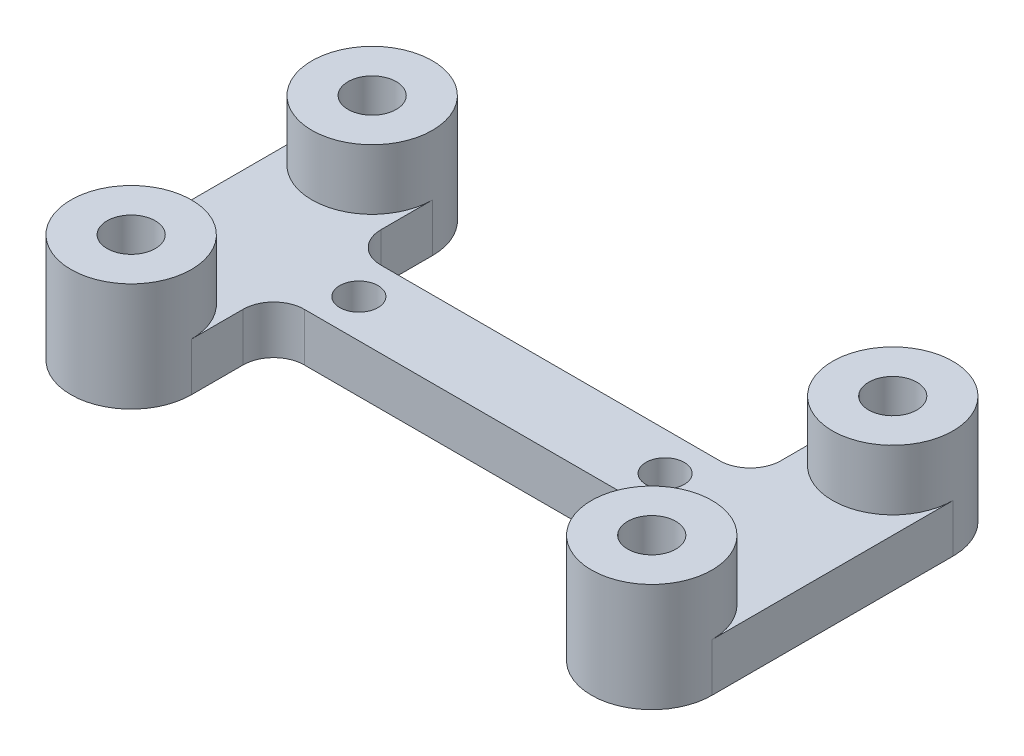
ISO-10303-21;
HEADER;
FILE_DESCRIPTION(('STEP AP214'),'2;1');
FILE_NAME('part.step','',(''),(''),'','','');
FILE_SCHEMA(('AUTOMOTIVE_DESIGN { 1 0 10303 214 1 1 1 1 }'));
ENDSEC;
DATA;
#1=APPLICATION_CONTEXT('core data for automotive mechanical design processes');
#2=APPLICATION_PROTOCOL_DEFINITION('international standard','automotive_design',2000,#1);
#3=PRODUCT_CONTEXT('',#1,'mechanical');
#4=PRODUCT('Part','Part','',(#3));
#5=PRODUCT_RELATED_PRODUCT_CATEGORY('part','',(#4));
#6=PRODUCT_DEFINITION_FORMATION('','',#4);
#7=PRODUCT_DEFINITION_CONTEXT('part definition',#1,'design');
#8=PRODUCT_DEFINITION('design','',#6,#7);
#9=PRODUCT_DEFINITION_SHAPE('','',#8);
#10=(LENGTH_UNIT() NAMED_UNIT(*) SI_UNIT(.MILLI.,.METRE.));
#11=(NAMED_UNIT(*) PLANE_ANGLE_UNIT() SI_UNIT($,.RADIAN.));
#12=(NAMED_UNIT(*) SI_UNIT($,.STERADIAN.) SOLID_ANGLE_UNIT());
#13=UNCERTAINTY_MEASURE_WITH_UNIT(LENGTH_MEASURE(1.E-05),#10,'distance_accuracy_value','');
#14=(GEOMETRIC_REPRESENTATION_CONTEXT(3) GLOBAL_UNCERTAINTY_ASSIGNED_CONTEXT((#13)) GLOBAL_UNIT_ASSIGNED_CONTEXT((#10,
#11,#12)) REPRESENTATION_CONTEXT('',''));
#15=CARTESIAN_POINT('',(0.,0.,0.));
#16=DIRECTION('',(0.,0.,1.));
#17=DIRECTION('',(1.,0.,0.));
#18=AXIS2_PLACEMENT_3D('',#15,#16,#17);
#19=CARTESIAN_POINT('',(21.59,9.,9.9949));
#20=DIRECTION('',(0.,1.,0.));
#21=DIRECTION('',(0.,0.,1.));
#22=AXIS2_PLACEMENT_3D('',#19,#20,#21);
#23=PLANE('',#22);
#24=CARTESIAN_POINT('',(21.59,9.,9.9949));
#25=DIRECTION('',(0.,1.,0.));
#26=DIRECTION('',(0.,0.,1.));
#27=AXIS2_PLACEMENT_3D('',#24,#25,#26);
#28=CIRCLE('',#27,5.);
#29=CARTESIAN_POINT('',(21.59,9.,14.9949));
#30=VERTEX_POINT('',#29);
#31=EDGE_CURVE('E65',#30,#30,#28,.T.);
#32=ORIENTED_EDGE('',*,*,#31,.T.);
#33=EDGE_LOOP('',(#32));
#34=FACE_BOUND('',#33,.T.);
#35=CARTESIAN_POINT('',(21.59,9.,9.9949));
#36=DIRECTION('',(0.,1.,0.));
#37=DIRECTION('',(0.,0.,1.));
#38=AXIS2_PLACEMENT_3D('',#35,#36,#37);
#39=CIRCLE('',#38,2.);
#40=CARTESIAN_POINT('',(21.59,9.,11.9949));
#41=VERTEX_POINT('',#40);
#42=EDGE_CURVE('E56',#41,#41,#39,.T.);
#43=ORIENTED_EDGE('',*,*,#42,.F.);
#44=EDGE_LOOP('',(#43));
#45=FACE_BOUND('',#44,.T.);
#46=ADVANCED_FACE('F52',(#34,#45),#23,.T.);
#47=CARTESIAN_POINT('',(21.59,0.,9.9949));
#48=DIRECTION('',(0.,1.,0.));
#49=DIRECTION('',(0.,0.,1.));
#50=AXIS2_PLACEMENT_3D('',#47,#48,#49);
#51=PLANE('',#50);
#52=CARTESIAN_POINT('',(21.59,0.,9.9949));
#53=DIRECTION('',(0.,1.,0.));
#54=DIRECTION('',(0.,0.,1.));
#55=AXIS2_PLACEMENT_3D('',#52,#53,#54);
#56=CIRCLE('',#55,5.);
#57=CARTESIAN_POINT('',(21.59,0.,14.9949));
#58=VERTEX_POINT('',#57);
#59=EDGE_CURVE('E63',#58,#58,#56,.T.);
#60=ORIENTED_EDGE('',*,*,#59,.F.);
#61=EDGE_LOOP('',(#60));
#62=FACE_BOUND('',#61,.T.);
#63=CARTESIAN_POINT('',(21.59,0.,9.9949));
#64=DIRECTION('',(0.,1.,0.));
#65=DIRECTION('',(0.,0.,1.));
#66=AXIS2_PLACEMENT_3D('',#63,#64,#65);
#67=CIRCLE('',#66,2.);
#68=CARTESIAN_POINT('',(21.59,0.,11.9949));
#69=VERTEX_POINT('',#68);
#70=EDGE_CURVE('E11',#69,#69,#67,.T.);
#71=ORIENTED_EDGE('',*,*,#70,.T.);
#72=EDGE_LOOP('',(#71));
#73=FACE_BOUND('',#72,.T.);
#74=ADVANCED_FACE('F73',(#62,#73),#51,.F.);
#75=CARTESIAN_POINT('',(21.59,9.,9.9949));
#76=DIRECTION('',(0.,-1.,0.));
#77=DIRECTION('',(0.,0.,-1.));
#78=AXIS2_PLACEMENT_3D('',#75,#76,#77);
#79=CYLINDRICAL_SURFACE('',#78,5.);
#80=ORIENTED_EDGE('',*,*,#31,.F.);
#81=EDGE_LOOP('',(#80));
#82=FACE_BOUND('',#81,.T.);
#83=ORIENTED_EDGE('',*,*,#59,.T.);
#84=EDGE_LOOP('',(#83));
#85=FACE_BOUND('',#84,.T.);
#86=ADVANCED_FACE('F71',(#82,#85),#79,.T.);
#87=CARTESIAN_POINT('',(21.59,9.,9.9949));
#88=DIRECTION('',(0.,-1.,0.));
#89=DIRECTION('',(0.,0.,-1.));
#90=AXIS2_PLACEMENT_3D('',#87,#88,#89);
#91=CYLINDRICAL_SURFACE('',#90,2.);
#92=ORIENTED_EDGE('',*,*,#42,.T.);
#93=EDGE_LOOP('',(#92));
#94=FACE_BOUND('',#93,.T.);
#95=ORIENTED_EDGE('',*,*,#70,.F.);
#96=EDGE_LOOP('',(#95));
#97=FACE_BOUND('',#96,.T.);
#98=ADVANCED_FACE('F54',(#94,#97),#91,.F.);
#99=CLOSED_SHELL('',(#46,#74,#86,#98));
#100=MANIFOLD_SOLID_BREP('B2',#99);
#101=CARTESIAN_POINT('',(21.59,9.,-9.9949));
#102=DIRECTION('',(0.,1.,0.));
#103=DIRECTION('',(0.,0.,1.));
#104=AXIS2_PLACEMENT_3D('',#101,#102,#103);
#105=PLANE('',#104);
#106=CARTESIAN_POINT('',(21.59,9.,-9.9949));
#107=DIRECTION('',(0.,1.,0.));
#108=DIRECTION('',(0.,0.,1.));
#109=AXIS2_PLACEMENT_3D('',#106,#107,#108);
#110=CIRCLE('',#109,5.);
#111=CARTESIAN_POINT('',(21.59,9.,-4.9949));
#112=VERTEX_POINT('',#111);
#113=EDGE_CURVE('E144',#112,#112,#110,.T.);
#114=ORIENTED_EDGE('',*,*,#113,.T.);
#115=EDGE_LOOP('',(#114));
#116=FACE_BOUND('',#115,.T.);
#117=CARTESIAN_POINT('',(21.59,9.,-9.9949));
#118=DIRECTION('',(0.,1.,0.));
#119=DIRECTION('',(0.,0.,1.));
#120=AXIS2_PLACEMENT_3D('',#117,#118,#119);
#121=CIRCLE('',#120,2.);
#122=CARTESIAN_POINT('',(21.59,9.,-7.9949));
#123=VERTEX_POINT('',#122);
#124=EDGE_CURVE('E135',#123,#123,#121,.T.);
#125=ORIENTED_EDGE('',*,*,#124,.F.);
#126=EDGE_LOOP('',(#125));
#127=FACE_BOUND('',#126,.T.);
#128=ADVANCED_FACE('F131',(#116,#127),#105,.T.);
#129=CARTESIAN_POINT('',(21.59,0.,-9.9949));
#130=DIRECTION('',(0.,1.,0.));
#131=DIRECTION('',(0.,0.,1.));
#132=AXIS2_PLACEMENT_3D('',#129,#130,#131);
#133=PLANE('',#132);
#134=CARTESIAN_POINT('',(21.59,0.,-9.9949));
#135=DIRECTION('',(0.,1.,0.));
#136=DIRECTION('',(0.,0.,1.));
#137=AXIS2_PLACEMENT_3D('',#134,#135,#136);
#138=CIRCLE('',#137,5.);
#139=CARTESIAN_POINT('',(21.59,0.,-4.9949));
#140=VERTEX_POINT('',#139);
#141=EDGE_CURVE('E142',#140,#140,#138,.T.);
#142=ORIENTED_EDGE('',*,*,#141,.F.);
#143=EDGE_LOOP('',(#142));
#144=FACE_BOUND('',#143,.T.);
#145=CARTESIAN_POINT('',(21.59,0.,-9.9949));
#146=DIRECTION('',(0.,1.,0.));
#147=DIRECTION('',(0.,0.,1.));
#148=AXIS2_PLACEMENT_3D('',#145,#146,#147);
#149=CIRCLE('',#148,2.);
#150=CARTESIAN_POINT('',(21.59,0.,-7.9949));
#151=VERTEX_POINT('',#150);
#152=EDGE_CURVE('E51',#151,#151,#149,.T.);
#153=ORIENTED_EDGE('',*,*,#152,.T.);
#154=EDGE_LOOP('',(#153));
#155=FACE_BOUND('',#154,.T.);
#156=ADVANCED_FACE('F152',(#144,#155),#133,.F.);
#157=CARTESIAN_POINT('',(21.59,9.,-9.9949));
#158=DIRECTION('',(0.,-1.,0.));
#159=DIRECTION('',(0.,0.,-1.));
#160=AXIS2_PLACEMENT_3D('',#157,#158,#159);
#161=CYLINDRICAL_SURFACE('',#160,5.);
#162=ORIENTED_EDGE('',*,*,#113,.F.);
#163=EDGE_LOOP('',(#162));
#164=FACE_BOUND('',#163,.T.);
#165=ORIENTED_EDGE('',*,*,#141,.T.);
#166=EDGE_LOOP('',(#165));
#167=FACE_BOUND('',#166,.T.);
#168=ADVANCED_FACE('F150',(#164,#167),#161,.T.);
#169=CARTESIAN_POINT('',(21.59,9.,-9.9949));
#170=DIRECTION('',(0.,-1.,0.));
#171=DIRECTION('',(0.,0.,-1.));
#172=AXIS2_PLACEMENT_3D('',#169,#170,#171);
#173=CYLINDRICAL_SURFACE('',#172,2.);
#174=ORIENTED_EDGE('',*,*,#124,.T.);
#175=EDGE_LOOP('',(#174));
#176=FACE_BOUND('',#175,.T.);
#177=ORIENTED_EDGE('',*,*,#152,.F.);
#178=EDGE_LOOP('',(#177));
#179=FACE_BOUND('',#178,.T.);
#180=ADVANCED_FACE('F133',(#176,#179),#173,.F.);
#181=CLOSED_SHELL('',(#128,#156,#168,#180));
#182=MANIFOLD_SOLID_BREP('B6',#181);
#183=CARTESIAN_POINT('',(0.,4.,0.));
#184=DIRECTION('',(0.,1.,0.));
#185=DIRECTION('',(0.,0.,1.));
#186=AXIS2_PLACEMENT_3D('',#183,#184,#185);
#187=PLANE('',#186);
#188=CARTESIAN_POINT('',(-12.7,4.,0.));
#189=DIRECTION('',(0.,1.,0.));
#190=DIRECTION('',(0.,0.,1.));
#191=AXIS2_PLACEMENT_3D('',#188,#189,#190);
#192=CIRCLE('',#191,1.5875);
#193=CARTESIAN_POINT('',(-12.7,4.,1.5875));
#194=VERTEX_POINT('',#193);
#195=EDGE_CURVE('E605',#194,#194,#192,.T.);
#196=ORIENTED_EDGE('',*,*,#195,.F.);
#197=EDGE_LOOP('',(#196));
#198=FACE_BOUND('',#197,.T.);
#199=CARTESIAN_POINT('',(12.7,4.,0.));
#200=DIRECTION('',(0.,1.,0.));
#201=DIRECTION('',(0.,0.,1.));
#202=AXIS2_PLACEMENT_3D('',#199,#200,#201);
#203=CIRCLE('',#202,1.5875);
#204=CARTESIAN_POINT('',(12.7,4.,1.5875));
#205=VERTEX_POINT('',#204);
#206=EDGE_CURVE('E609',#205,#205,#203,.T.);
#207=ORIENTED_EDGE('',*,*,#206,.F.);
#208=EDGE_LOOP('',(#207));
#209=FACE_BOUND('',#208,.T.);
#210=DIRECTION('',(0.,0.,-1.));
#211=VECTOR('',#210,1.);
#212=CARTESIAN_POINT('',(-26.59,4.,0.));
#213=LINE('',#212,#211);
#214=CARTESIAN_POINT('',(-26.59,4.,9.9949));
#215=VERTEX_POINT('',#214);
#216=CARTESIAN_POINT('',(-26.59,4.,-9.9949));
#217=VERTEX_POINT('',#216);
#218=EDGE_CURVE('E460',#215,#217,#213,.T.);
#219=ORIENTED_EDGE('',*,*,#218,.F.);
#220=CARTESIAN_POINT('',(-21.59,4.,9.9949));
#221=DIRECTION('',(0.,1.,0.));
#222=DIRECTION('',(0.,0.,1.));
#223=AXIS2_PLACEMENT_3D('',#220,#221,#222);
#224=CIRCLE('',#223,5.);
#225=CARTESIAN_POINT('',(-16.59,4.,9.9949));
#226=VERTEX_POINT('',#225);
#227=EDGE_CURVE('E442',#215,#226,#224,.F.);
#228=ORIENTED_EDGE('',*,*,#227,.T.);
#229=DIRECTION('',(0.,0.,-1.));
#230=VECTOR('',#229,1.);
#231=CARTESIAN_POINT('',(-16.59,4.,0.));
#232=LINE('',#231,#230);
#233=CARTESIAN_POINT('',(-16.59,4.,5.715));
#234=VERTEX_POINT('',#233);
#235=EDGE_CURVE('E447',#226,#234,#232,.T.);
#236=ORIENTED_EDGE('',*,*,#235,.T.);
#237=CARTESIAN_POINT('',(-14.05,4.,5.715));
#238=DIRECTION('',(0.,1.,0.));
#239=DIRECTION('',(0.,0.,1.));
#240=AXIS2_PLACEMENT_3D('',#237,#238,#239);
#241=CIRCLE('',#240,2.54);
#242=CARTESIAN_POINT('',(-14.05,4.,3.175));
#243=VERTEX_POINT('',#242);
#244=EDGE_CURVE('E129',#234,#243,#241,.F.);
#245=ORIENTED_EDGE('',*,*,#244,.T.);
#246=DIRECTION('',(-1.,0.,0.));
#247=VECTOR('',#246,1.);
#248=CARTESIAN_POINT('',(0.,4.,3.175));
#249=LINE('',#248,#247);
#250=CARTESIAN_POINT('',(14.05,4.,3.175));
#251=VERTEX_POINT('',#250);
#252=EDGE_CURVE('E450',#251,#243,#249,.T.);
#253=ORIENTED_EDGE('',*,*,#252,.F.);
#254=CARTESIAN_POINT('',(14.05,4.,5.715));
#255=DIRECTION('',(0.,1.,0.));
#256=DIRECTION('',(0.,0.,1.));
#257=AXIS2_PLACEMENT_3D('',#254,#255,#256);
#258=CIRCLE('',#257,2.54);
#259=CARTESIAN_POINT('',(16.59,4.,5.715));
#260=VERTEX_POINT('',#259);
#261=EDGE_CURVE('E544',#251,#260,#258,.F.);
#262=ORIENTED_EDGE('',*,*,#261,.T.);
#263=DIRECTION('',(0.,0.,-1.));
#264=VECTOR('',#263,1.);
#265=CARTESIAN_POINT('',(16.59,4.,0.));
#266=LINE('',#265,#264);
#267=CARTESIAN_POINT('',(16.59,4.,9.9949));
#268=VERTEX_POINT('',#267);
#269=EDGE_CURVE('E374',#268,#260,#266,.T.);
#270=ORIENTED_EDGE('',*,*,#269,.F.);
#271=DIRECTION('',(-1.,0.,0.));
#272=VECTOR('',#271,1.);
#273=CARTESIAN_POINT('',(0.,4.,9.9949));
#274=LINE('',#273,#272);
#275=CARTESIAN_POINT('',(19.59,4.,9.9949));
#276=VERTEX_POINT('',#275);
#277=EDGE_CURVE('E347',#276,#268,#274,.T.);
#278=ORIENTED_EDGE('',*,*,#277,.F.);
#279=CARTESIAN_POINT('',(21.59,4.,9.9949));
#280=DIRECTION('',(0.,-1.,0.));
#281=DIRECTION('',(0.,0.,1.));
#282=AXIS2_PLACEMENT_3D('',#279,#280,#281);
#283=CIRCLE('',#282,2.00000000000001);
#284=CARTESIAN_POINT('',(23.59,4.,9.9949));
#285=VERTEX_POINT('',#284);
#286=EDGE_CURVE('E340',#276,#285,#283,.T.);
#287=ORIENTED_EDGE('',*,*,#286,.T.);
#288=CARTESIAN_POINT('',(26.59,4.,9.9949));
#289=VERTEX_POINT('',#288);
#290=EDGE_CURVE('E344',#289,#285,#274,.T.);
#291=ORIENTED_EDGE('',*,*,#290,.F.);
#292=DIRECTION('',(0.,0.,-1.));
#293=VECTOR('',#292,1.);
#294=CARTESIAN_POINT('',(26.59,4.,0.));
#295=LINE('',#294,#293);
#296=CARTESIAN_POINT('',(26.59,4.,-9.9949));
#297=VERTEX_POINT('',#296);
#298=EDGE_CURVE('E367',#289,#297,#295,.T.);
#299=ORIENTED_EDGE('',*,*,#298,.T.);
#300=DIRECTION('',(-1.,0.,0.));
#301=VECTOR('',#300,1.);
#302=CARTESIAN_POINT('',(0.,4.,-9.9949));
#303=LINE('',#302,#301);
#304=CARTESIAN_POINT('',(23.59,4.,-9.9949));
#305=VERTEX_POINT('',#304);
#306=EDGE_CURVE('E370',#297,#305,#303,.T.);
#307=ORIENTED_EDGE('',*,*,#306,.T.);
#308=CARTESIAN_POINT('',(21.59,4.,-9.9949));
#309=DIRECTION('',(0.,-1.,0.));
#310=DIRECTION('',(0.,0.,1.));
#311=AXIS2_PLACEMENT_3D('',#308,#309,#310);
#312=CIRCLE('',#311,2.00000000000001);
#313=CARTESIAN_POINT('',(19.59,4.,-9.9949));
#314=VERTEX_POINT('',#313);
#315=EDGE_CURVE('E390',#305,#314,#312,.T.);
#316=ORIENTED_EDGE('',*,*,#315,.T.);
#317=CARTESIAN_POINT('',(16.59,4.,-9.9949));
#318=VERTEX_POINT('',#317);
#319=EDGE_CURVE('E387',#314,#318,#303,.T.);
#320=ORIENTED_EDGE('',*,*,#319,.T.);
#321=CARTESIAN_POINT('',(16.59,4.,-5.715));
#322=VERTEX_POINT('',#321);
#323=EDGE_CURVE('E381',#322,#318,#266,.T.);
#324=ORIENTED_EDGE('',*,*,#323,.F.);
#325=CARTESIAN_POINT('',(14.05,4.,-5.715));
#326=DIRECTION('',(0.,1.,0.));
#327=DIRECTION('',(0.,0.,1.));
#328=AXIS2_PLACEMENT_3D('',#325,#326,#327);
#329=CIRCLE('',#328,2.54);
#330=CARTESIAN_POINT('',(14.05,4.,-3.175));
#331=VERTEX_POINT('',#330);
#332=EDGE_CURVE('E550',#322,#331,#329,.F.);
#333=ORIENTED_EDGE('',*,*,#332,.T.);
#334=DIRECTION('',(-1.,0.,0.));
#335=VECTOR('',#334,1.);
#336=CARTESIAN_POINT('',(0.,4.,-3.175));
#337=LINE('',#336,#335);
#338=CARTESIAN_POINT('',(-14.05,4.,-3.175));
#339=VERTEX_POINT('',#338);
#340=EDGE_CURVE('E456',#331,#339,#337,.T.);
#341=ORIENTED_EDGE('',*,*,#340,.T.);
#342=CARTESIAN_POINT('',(-14.05,4.,-5.715));
#343=DIRECTION('',(0.,1.,0.));
#344=DIRECTION('',(0.,0.,1.));
#345=AXIS2_PLACEMENT_3D('',#342,#343,#344);
#346=CIRCLE('',#345,2.54);
#347=CARTESIAN_POINT('',(-16.59,4.,-5.715));
#348=VERTEX_POINT('',#347);
#349=EDGE_CURVE('E556',#339,#348,#346,.F.);
#350=ORIENTED_EDGE('',*,*,#349,.T.);
#351=CARTESIAN_POINT('',(-16.59,4.,-9.9949));
#352=VERTEX_POINT('',#351);
#353=EDGE_CURVE('E452',#348,#352,#232,.T.);
#354=ORIENTED_EDGE('',*,*,#353,.T.);
#355=CARTESIAN_POINT('',(-21.59,4.,-9.9949));
#356=DIRECTION('',(0.,1.,0.));
#357=DIRECTION('',(0.,0.,1.));
#358=AXIS2_PLACEMENT_3D('',#355,#356,#357);
#359=CIRCLE('',#358,5.);
#360=EDGE_CURVE('E496',#217,#352,#359,.T.);
#361=ORIENTED_EDGE('',*,*,#360,.F.);
#362=EDGE_LOOP('',(#219,#228,#236,#245,#253,#262,#270,#278,#287,#291,#299,#307,#316,#320,#324,
#333,#341,#350,#354,#361));
#363=FACE_BOUND('',#362,.T.);
#364=ADVANCED_FACE('F201',(#198,#209,#363),#187,.T.);
#365=CARTESIAN_POINT('',(-21.59,9.,-9.9949));
#366=DIRECTION('',(0.,1.,0.));
#367=DIRECTION('',(0.,0.,1.));
#368=AXIS2_PLACEMENT_3D('',#365,#366,#367);
#369=PLANE('',#368);
#370=CARTESIAN_POINT('',(-21.59,9.,-9.9949));
#371=DIRECTION('',(0.,1.,0.));
#372=DIRECTION('',(0.,0.,1.));
#373=AXIS2_PLACEMENT_3D('',#370,#371,#372);
#374=CIRCLE('',#373,5.);
#375=CARTESIAN_POINT('',(-21.59,9.,-4.9949));
#376=VERTEX_POINT('',#375);
#377=EDGE_CURVE('E509',#376,#376,#374,.T.);
#378=ORIENTED_EDGE('',*,*,#377,.T.);
#379=EDGE_LOOP('',(#378));
#380=FACE_BOUND('',#379,.T.);
#381=CARTESIAN_POINT('',(-21.59,9.,-9.9949));
#382=DIRECTION('',(0.,1.,0.));
#383=DIRECTION('',(0.,0.,1.));
#384=AXIS2_PLACEMENT_3D('',#381,#382,#383);
#385=CIRCLE('',#384,2.);
#386=CARTESIAN_POINT('',(-21.59,9.,-7.9949));
#387=VERTEX_POINT('',#386);
#388=EDGE_CURVE('E501',#387,#387,#385,.T.);
#389=ORIENTED_EDGE('',*,*,#388,.F.);
#390=EDGE_LOOP('',(#389));
#391=FACE_BOUND('',#390,.T.);
#392=ADVANCED_FACE('F629',(#380,#391),#369,.T.);
#393=CARTESIAN_POINT('',(-21.59,0.,-9.9949));
#394=DIRECTION('',(0.,1.,0.));
#395=DIRECTION('',(0.,0.,1.));
#396=AXIS2_PLACEMENT_3D('',#393,#394,#395);
#397=PLANE('',#396);
#398=CARTESIAN_POINT('',(-12.7,0.,0.));
#399=DIRECTION('',(0.,1.,0.));
#400=DIRECTION('',(0.,0.,1.));
#401=AXIS2_PLACEMENT_3D('',#398,#399,#400);
#402=CIRCLE('',#401,1.5875);
#403=CARTESIAN_POINT('',(-12.7,0.,1.5875));
#404=VERTEX_POINT('',#403);
#405=EDGE_CURVE('E395',#404,#404,#402,.T.);
#406=ORIENTED_EDGE('',*,*,#405,.T.);
#407=EDGE_LOOP('',(#406));
#408=FACE_BOUND('',#407,.T.);
#409=CARTESIAN_POINT('',(12.7,0.,0.));
#410=DIRECTION('',(0.,1.,0.));
#411=DIRECTION('',(0.,0.,1.));
#412=AXIS2_PLACEMENT_3D('',#409,#410,#411);
#413=CIRCLE('',#412,1.5875);
#414=CARTESIAN_POINT('',(12.7,0.,1.5875));
#415=VERTEX_POINT('',#414);
#416=EDGE_CURVE('E613',#415,#415,#413,.T.);
#417=ORIENTED_EDGE('',*,*,#416,.T.);
#418=EDGE_LOOP('',(#417));
#419=FACE_BOUND('',#418,.T.);
#420=CARTESIAN_POINT('',(-21.59,0.,9.9949));
#421=DIRECTION('',(0.,1.,0.));
#422=DIRECTION('',(0.,0.,1.));
#423=AXIS2_PLACEMENT_3D('',#420,#421,#422);
#424=CIRCLE('',#423,5.);
#425=CARTESIAN_POINT('',(-26.59,0.,9.9949));
#426=VERTEX_POINT('',#425);
#427=CARTESIAN_POINT('',(-16.59,0.,9.9949));
#428=VERTEX_POINT('',#427);
#429=EDGE_CURVE('E432',#426,#428,#424,.T.);
#430=ORIENTED_EDGE('',*,*,#429,.F.);
#431=DIRECTION('',(0.,0.,-1.));
#432=VECTOR('',#431,1.);
#433=CARTESIAN_POINT('',(-26.59,0.,0.));
#434=LINE('',#433,#432);
#435=CARTESIAN_POINT('',(-26.59,0.,-9.9949));
#436=VERTEX_POINT('',#435);
#437=EDGE_CURVE('E451',#426,#436,#434,.T.);
#438=ORIENTED_EDGE('',*,*,#437,.T.);
#439=CARTESIAN_POINT('',(-21.59,0.,-9.9949));
#440=DIRECTION('',(0.,1.,0.));
#441=DIRECTION('',(0.,0.,1.));
#442=AXIS2_PLACEMENT_3D('',#439,#440,#441);
#443=CIRCLE('',#442,5.);
#444=CARTESIAN_POINT('',(-16.59,0.,-9.9949));
#445=VERTEX_POINT('',#444);
#446=EDGE_CURVE('E505',#445,#436,#443,.T.);
#447=ORIENTED_EDGE('',*,*,#446,.F.);
#448=DIRECTION('',(0.,0.,-1.));
#449=VECTOR('',#448,1.);
#450=CARTESIAN_POINT('',(-16.59,0.,0.));
#451=LINE('',#450,#449);
#452=CARTESIAN_POINT('',(-16.59,0.,-5.715));
#453=VERTEX_POINT('',#452);
#454=EDGE_CURVE('E472',#453,#445,#451,.T.);
#455=ORIENTED_EDGE('',*,*,#454,.F.);
#456=CARTESIAN_POINT('',(-14.05,0.,-5.715));
#457=DIRECTION('',(0.,1.,0.));
#458=DIRECTION('',(0.,0.,1.));
#459=AXIS2_PLACEMENT_3D('',#456,#457,#458);
#460=CIRCLE('',#459,2.54);
#461=CARTESIAN_POINT('',(-14.05,0.,-3.175));
#462=VERTEX_POINT('',#461);
#463=EDGE_CURVE('E553',#453,#462,#460,.T.);
#464=ORIENTED_EDGE('',*,*,#463,.T.);
#465=DIRECTION('',(-1.,0.,0.));
#466=VECTOR('',#465,1.);
#467=CARTESIAN_POINT('',(0.,0.,-3.175));
#468=LINE('',#467,#466);
#469=CARTESIAN_POINT('',(14.05,0.,-3.175));
#470=VERTEX_POINT('',#469);
#471=EDGE_CURVE('E475',#470,#462,#468,.T.);
#472=ORIENTED_EDGE('',*,*,#471,.F.);
#473=CARTESIAN_POINT('',(14.05,0.,-5.715));
#474=DIRECTION('',(0.,1.,0.));
#475=DIRECTION('',(0.,0.,1.));
#476=AXIS2_PLACEMENT_3D('',#473,#474,#475);
#477=CIRCLE('',#476,2.54);
#478=CARTESIAN_POINT('',(16.59,0.,-5.715));
#479=VERTEX_POINT('',#478);
#480=EDGE_CURVE('E547',#470,#479,#477,.T.);
#481=ORIENTED_EDGE('',*,*,#480,.T.);
#482=DIRECTION('',(0.,0.,-1.));
#483=VECTOR('',#482,1.);
#484=CARTESIAN_POINT('',(16.59,0.,0.));
#485=LINE('',#484,#483);
#486=CARTESIAN_POINT('',(16.59,0.,-9.9949));
#487=VERTEX_POINT('',#486);
#488=EDGE_CURVE('E408',#479,#487,#485,.T.);
#489=ORIENTED_EDGE('',*,*,#488,.T.);
#490=DIRECTION('',(-1.,0.,0.));
#491=VECTOR('',#490,1.);
#492=CARTESIAN_POINT('',(0.,0.,-9.9949));
#493=LINE('',#492,#491);
#494=CARTESIAN_POINT('',(19.59,0.,-9.9949));
#495=VERTEX_POINT('',#494);
#496=EDGE_CURVE('E405',#495,#487,#493,.T.);
#497=ORIENTED_EDGE('',*,*,#496,.F.);
#498=CARTESIAN_POINT('',(21.59,0.,-9.9949));
#499=DIRECTION('',(0.,-1.,0.));
#500=DIRECTION('',(0.,0.,1.));
#501=AXIS2_PLACEMENT_3D('',#498,#499,#500);
#502=CIRCLE('',#501,2.00000000000001);
#503=CARTESIAN_POINT('',(23.59,0.,-9.9949));
#504=VERTEX_POINT('',#503);
#505=EDGE_CURVE('E404',#504,#495,#502,.T.);
#506=ORIENTED_EDGE('',*,*,#505,.F.);
#507=CARTESIAN_POINT('',(26.59,0.,-9.9949));
#508=VERTEX_POINT('',#507);
#509=EDGE_CURVE('E401',#508,#504,#493,.T.);
#510=ORIENTED_EDGE('',*,*,#509,.F.);
#511=DIRECTION('',(0.,0.,-1.));
#512=VECTOR('',#511,1.);
#513=CARTESIAN_POINT('',(26.59,0.,0.));
#514=LINE('',#513,#512);
#515=CARTESIAN_POINT('',(26.59,0.,9.9949));
#516=VERTEX_POINT('',#515);
#517=EDGE_CURVE('E398',#516,#508,#514,.T.);
#518=ORIENTED_EDGE('',*,*,#517,.F.);
#519=DIRECTION('',(-1.,0.,0.));
#520=VECTOR('',#519,1.);
#521=CARTESIAN_POINT('',(0.,0.,9.9949));
#522=LINE('',#521,#520);
#523=CARTESIAN_POINT('',(23.59,0.,9.9949));
#524=VERTEX_POINT('',#523);
#525=EDGE_CURVE('E394',#516,#524,#522,.T.);
#526=ORIENTED_EDGE('',*,*,#525,.T.);
#527=CARTESIAN_POINT('',(21.59,0.,9.9949));
#528=DIRECTION('',(0.,-1.,0.));
#529=DIRECTION('',(0.,0.,1.));
#530=AXIS2_PLACEMENT_3D('',#527,#528,#529);
#531=CIRCLE('',#530,2.00000000000001);
#532=CARTESIAN_POINT('',(19.59,0.,9.9949));
#533=VERTEX_POINT('',#532);
#534=EDGE_CURVE('E356',#533,#524,#531,.T.);
#535=ORIENTED_EDGE('',*,*,#534,.F.);
#536=CARTESIAN_POINT('',(16.59,0.,9.9949));
#537=VERTEX_POINT('',#536);
#538=EDGE_CURVE('E350',#533,#537,#522,.T.);
#539=ORIENTED_EDGE('',*,*,#538,.T.);
#540=CARTESIAN_POINT('',(16.59,0.,5.715));
#541=VERTEX_POINT('',#540);
#542=EDGE_CURVE('E410',#537,#541,#485,.T.);
#543=ORIENTED_EDGE('',*,*,#542,.T.);
#544=CARTESIAN_POINT('',(14.05,0.,5.715));
#545=DIRECTION('',(0.,1.,0.));
#546=DIRECTION('',(0.,0.,1.));
#547=AXIS2_PLACEMENT_3D('',#544,#545,#546);
#548=CIRCLE('',#547,2.54);
#549=CARTESIAN_POINT('',(14.05,0.,3.175));
#550=VERTEX_POINT('',#549);
#551=EDGE_CURVE('E541',#541,#550,#548,.T.);
#552=ORIENTED_EDGE('',*,*,#551,.T.);
#553=DIRECTION('',(-1.,0.,0.));
#554=VECTOR('',#553,1.);
#555=CARTESIAN_POINT('',(0.,0.,3.175));
#556=LINE('',#555,#554);
#557=CARTESIAN_POINT('',(-14.05,0.,3.175));
#558=VERTEX_POINT('',#557);
#559=EDGE_CURVE('E471',#550,#558,#556,.T.);
#560=ORIENTED_EDGE('',*,*,#559,.T.);
#561=CARTESIAN_POINT('',(-14.05,0.,5.715));
#562=DIRECTION('',(0.,1.,0.));
#563=DIRECTION('',(0.,0.,1.));
#564=AXIS2_PLACEMENT_3D('',#561,#562,#563);
#565=CIRCLE('',#564,2.54);
#566=CARTESIAN_POINT('',(-16.59,0.,5.715));
#567=VERTEX_POINT('',#566);
#568=EDGE_CURVE('E210',#558,#567,#565,.T.);
#569=ORIENTED_EDGE('',*,*,#568,.T.);
#570=EDGE_CURVE('E468',#428,#567,#451,.T.);
#571=ORIENTED_EDGE('',*,*,#570,.F.);
#572=EDGE_LOOP('',(#430,#438,#447,#455,#464,#472,#481,#489,#497,#506,#510,#518,#526,#535,#539,
#543,#552,#560,#569,#571));
#573=FACE_BOUND('',#572,.T.);
#574=CARTESIAN_POINT('',(-21.59,0.,9.9949));
#575=DIRECTION('',(0.,1.,0.));
#576=DIRECTION('',(0.,0.,1.));
#577=AXIS2_PLACEMENT_3D('',#574,#575,#576);
#578=CIRCLE('',#577,2.00000000000001);
#579=CARTESIAN_POINT('',(-21.59,0.,11.9949));
#580=VERTEX_POINT('',#579);
#581=EDGE_CURVE('E446',#580,#580,#578,.T.);
#582=ORIENTED_EDGE('',*,*,#581,.T.);
#583=EDGE_LOOP('',(#582));
#584=FACE_BOUND('',#583,.T.);
#585=CARTESIAN_POINT('',(-21.59,0.,-9.9949));
#586=DIRECTION('',(0.,1.,0.));
#587=DIRECTION('',(0.,0.,1.));
#588=AXIS2_PLACEMENT_3D('',#585,#586,#587);
#589=CIRCLE('',#588,2.);
#590=CARTESIAN_POINT('',(-21.59,0.,-7.9949));
#591=VERTEX_POINT('',#590);
#592=EDGE_CURVE('E500',#591,#591,#589,.T.);
#593=ORIENTED_EDGE('',*,*,#592,.T.);
#594=EDGE_LOOP('',(#593));
#595=FACE_BOUND('',#594,.T.);
#596=ADVANCED_FACE('F569',(#408,#419,#573,#584,#595),#397,.F.);
#597=CARTESIAN_POINT('',(-21.59,9.,-9.9949));
#598=DIRECTION('',(0.,-1.,0.));
#599=DIRECTION('',(0.,0.,-1.));
#600=AXIS2_PLACEMENT_3D('',#597,#598,#599);
#601=CYLINDRICAL_SURFACE('',#600,5.);
#602=ORIENTED_EDGE('',*,*,#360,.T.);
#603=DIRECTION('',(0.,-1.,0.));
#604=VECTOR('',#603,1.);
#605=CARTESIAN_POINT('',(-16.59,4.,-9.9949));
#606=LINE('',#605,#604);
#607=EDGE_CURVE('E488',#352,#445,#606,.T.);
#608=ORIENTED_EDGE('',*,*,#607,.T.);
#609=ORIENTED_EDGE('',*,*,#446,.T.);
#610=DIRECTION('',(0.,-1.,0.));
#611=VECTOR('',#610,1.);
#612=CARTESIAN_POINT('',(-26.59,4.,-9.9949));
#613=LINE('',#612,#611);
#614=EDGE_CURVE('E484',#217,#436,#613,.T.);
#615=ORIENTED_EDGE('',*,*,#614,.F.);
#616=EDGE_LOOP('',(#602,#608,#609,#615));
#617=FACE_BOUND('',#616,.T.);
#618=ORIENTED_EDGE('',*,*,#377,.F.);
#619=EDGE_LOOP('',(#618));
#620=FACE_BOUND('',#619,.T.);
#621=ADVANCED_FACE('F573',(#617,#620),#601,.T.);
#622=CARTESIAN_POINT('',(-21.59,9.,-9.9949));
#623=DIRECTION('',(0.,-1.,0.));
#624=DIRECTION('',(0.,0.,-1.));
#625=AXIS2_PLACEMENT_3D('',#622,#623,#624);
#626=CYLINDRICAL_SURFACE('',#625,2.);
#627=ORIENTED_EDGE('',*,*,#592,.F.);
#628=EDGE_LOOP('',(#627));
#629=FACE_BOUND('',#628,.T.);
#630=ORIENTED_EDGE('',*,*,#388,.T.);
#631=EDGE_LOOP('',(#630));
#632=FACE_BOUND('',#631,.T.);
#633=ADVANCED_FACE('F655',(#629,#632),#626,.F.);
#634=CARTESIAN_POINT('',(-21.59,4.,9.9949));
#635=DIRECTION('',(0.,-1.,0.));
#636=DIRECTION('',(0.,0.,-1.));
#637=AXIS2_PLACEMENT_3D('',#634,#635,#636);
#638=CYLINDRICAL_SURFACE('',#637,2.00000000000001);
#639=ORIENTED_EDGE('',*,*,#581,.F.);
#640=EDGE_LOOP('',(#639));
#641=FACE_BOUND('',#640,.T.);
#642=CARTESIAN_POINT('',(-21.59,9.,9.9949));
#643=DIRECTION('',(0.,1.,0.));
#644=DIRECTION('',(0.,0.,1.));
#645=AXIS2_PLACEMENT_3D('',#642,#643,#644);
#646=CIRCLE('',#645,2.);
#647=CARTESIAN_POINT('',(-21.59,9.,11.9949));
#648=VERTEX_POINT('',#647);
#649=EDGE_CURVE('E435',#648,#648,#646,.T.);
#650=ORIENTED_EDGE('',*,*,#649,.T.);
#651=EDGE_LOOP('',(#650));
#652=FACE_BOUND('',#651,.T.);
#653=ADVANCED_FACE('F652',(#641,#652),#638,.F.);
#654=CARTESIAN_POINT('',(-16.59,4.,0.));
#655=DIRECTION('',(-1.,0.,0.));
#656=DIRECTION('',(0.,0.,1.));
#657=AXIS2_PLACEMENT_3D('',#654,#655,#656);
#658=PLANE('',#657);
#659=ORIENTED_EDGE('',*,*,#570,.T.);
#660=DIRECTION('',(0.,-1.,0.));
#661=VECTOR('',#660,1.);
#662=CARTESIAN_POINT('',(-16.59,4.,5.715));
#663=LINE('',#662,#661);
#664=EDGE_CURVE('E217',#567,#234,#663,.F.);
#665=ORIENTED_EDGE('',*,*,#664,.T.);
#666=ORIENTED_EDGE('',*,*,#235,.F.);
#667=DIRECTION('',(0.,-1.,0.));
#668=VECTOR('',#667,1.);
#669=CARTESIAN_POINT('',(-16.59,4.,9.9949));
#670=LINE('',#669,#668);
#671=EDGE_CURVE('E492',#226,#428,#670,.T.);
#672=ORIENTED_EDGE('',*,*,#671,.T.);
#673=EDGE_LOOP('',(#659,#665,#666,#672));
#674=FACE_BOUND('',#673,.T.);
#675=ADVANCED_FACE('F581',(#674),#658,.F.);
#676=CARTESIAN_POINT('',(0.,4.,3.175));
#677=DIRECTION('',(0.,0.,1.));
#678=DIRECTION('',(1.,0.,0.));
#679=AXIS2_PLACEMENT_3D('',#676,#677,#678);
#680=PLANE('',#679);
#681=ORIENTED_EDGE('',*,*,#559,.F.);
#682=DIRECTION('',(0.,-1.,0.));
#683=VECTOR('',#682,1.);
#684=CARTESIAN_POINT('',(14.05,4.,3.175));
#685=LINE('',#684,#683);
#686=EDGE_CURVE('E522',#550,#251,#685,.F.);
#687=ORIENTED_EDGE('',*,*,#686,.T.);
#688=ORIENTED_EDGE('',*,*,#252,.T.);
#689=DIRECTION('',(0.,-1.,0.));
#690=VECTOR('',#689,1.);
#691=CARTESIAN_POINT('',(-14.05,4.,3.175));
#692=LINE('',#691,#690);
#693=EDGE_CURVE('E518',#243,#558,#692,.T.);
#694=ORIENTED_EDGE('',*,*,#693,.T.);
#695=EDGE_LOOP('',(#681,#687,#688,#694));
#696=FACE_BOUND('',#695,.T.);
#697=ADVANCED_FACE('F589',(#696),#680,.T.);
#698=CARTESIAN_POINT('',(0.,4.,-3.175));
#699=DIRECTION('',(0.,0.,1.));
#700=DIRECTION('',(1.,0.,0.));
#701=AXIS2_PLACEMENT_3D('',#698,#699,#700);
#702=PLANE('',#701);
#703=ORIENTED_EDGE('',*,*,#340,.F.);
#704=DIRECTION('',(0.,-1.,0.));
#705=VECTOR('',#704,1.);
#706=CARTESIAN_POINT('',(14.05,4.,-3.175));
#707=LINE('',#706,#705);
#708=EDGE_CURVE('E528',#331,#470,#707,.T.);
#709=ORIENTED_EDGE('',*,*,#708,.T.);
#710=ORIENTED_EDGE('',*,*,#471,.T.);
#711=DIRECTION('',(0.,-1.,0.));
#712=VECTOR('',#711,1.);
#713=CARTESIAN_POINT('',(-14.05,4.,-3.175));
#714=LINE('',#713,#712);
#715=EDGE_CURVE('E525',#462,#339,#714,.F.);
#716=ORIENTED_EDGE('',*,*,#715,.T.);
#717=EDGE_LOOP('',(#703,#709,#710,#716));
#718=FACE_BOUND('',#717,.T.);
#719=ADVANCED_FACE('F646',(#718),#702,.F.);
#720=ORIENTED_EDGE('',*,*,#353,.F.);
#721=DIRECTION('',(0.,-1.,0.));
#722=VECTOR('',#721,1.);
#723=CARTESIAN_POINT('',(-16.59,0.,-5.715));
#724=LINE('',#723,#722);
#725=EDGE_CURVE('E535',#348,#453,#724,.T.);
#726=ORIENTED_EDGE('',*,*,#725,.T.);
#727=ORIENTED_EDGE('',*,*,#454,.T.);
#728=ORIENTED_EDGE('',*,*,#607,.F.);
#729=EDGE_LOOP('',(#720,#726,#727,#728));
#730=FACE_BOUND('',#729,.T.);
#731=ADVANCED_FACE('F566',(#730),#658,.F.);
#732=CARTESIAN_POINT('',(-26.59,4.,0.));
#733=DIRECTION('',(-1.,0.,0.));
#734=DIRECTION('',(0.,0.,1.));
#735=AXIS2_PLACEMENT_3D('',#732,#733,#734);
#736=PLANE('',#735);
#737=ORIENTED_EDGE('',*,*,#437,.F.);
#738=DIRECTION('',(0.,-1.,0.));
#739=VECTOR('',#738,1.);
#740=CARTESIAN_POINT('',(-26.59,4.,9.9949));
#741=LINE('',#740,#739);
#742=EDGE_CURVE('E464',#215,#426,#741,.T.);
#743=ORIENTED_EDGE('',*,*,#742,.F.);
#744=ORIENTED_EDGE('',*,*,#218,.T.);
#745=ORIENTED_EDGE('',*,*,#614,.T.);
#746=EDGE_LOOP('',(#737,#743,#744,#745));
#747=FACE_BOUND('',#746,.T.);
#748=ADVANCED_FACE('F578',(#747),#736,.T.);
#749=CARTESIAN_POINT('',(-21.59,9.,9.9949));
#750=DIRECTION('',(0.,-1.,0.));
#751=DIRECTION('',(0.,0.,-1.));
#752=AXIS2_PLACEMENT_3D('',#749,#750,#751);
#753=CYLINDRICAL_SURFACE('',#752,5.);
#754=CARTESIAN_POINT('',(-21.59,9.,9.9949));
#755=DIRECTION('',(0.,1.,0.));
#756=DIRECTION('',(0.,0.,1.));
#757=AXIS2_PLACEMENT_3D('',#754,#755,#756);
#758=CIRCLE('',#757,5.);
#759=CARTESIAN_POINT('',(-21.59,9.,14.9949));
#760=VERTEX_POINT('',#759);
#761=EDGE_CURVE('E361',#760,#760,#758,.T.);
#762=ORIENTED_EDGE('',*,*,#761,.F.);
#763=EDGE_LOOP('',(#762));
#764=FACE_BOUND('',#763,.T.);
#765=ORIENTED_EDGE('',*,*,#429,.T.);
#766=ORIENTED_EDGE('',*,*,#671,.F.);
#767=ORIENTED_EDGE('',*,*,#227,.F.);
#768=ORIENTED_EDGE('',*,*,#742,.T.);
#769=EDGE_LOOP('',(#765,#766,#767,#768));
#770=FACE_BOUND('',#769,.T.);
#771=ADVANCED_FACE('F580',(#764,#770),#753,.T.);
#772=CARTESIAN_POINT('',(-21.59,9.,9.9949));
#773=DIRECTION('',(0.,1.,0.));
#774=DIRECTION('',(0.,0.,1.));
#775=AXIS2_PLACEMENT_3D('',#772,#773,#774);
#776=PLANE('',#775);
#777=ORIENTED_EDGE('',*,*,#761,.T.);
#778=EDGE_LOOP('',(#777));
#779=FACE_BOUND('',#778,.T.);
#780=ORIENTED_EDGE('',*,*,#649,.F.);
#781=EDGE_LOOP('',(#780));
#782=FACE_BOUND('',#781,.T.);
#783=ADVANCED_FACE('F640',(#779,#782),#776,.T.);
#784=CARTESIAN_POINT('',(21.59,4.,9.9949));
#785=DIRECTION('',(0.,-1.,0.));
#786=DIRECTION('',(0.,0.,-1.));
#787=AXIS2_PLACEMENT_3D('',#784,#785,#786);
#788=CYLINDRICAL_SURFACE('',#787,2.00000000000001);
#789=ORIENTED_EDGE('',*,*,#534,.T.);
#790=DIRECTION('',(0.,-1.,0.));
#791=VECTOR('',#790,1.);
#792=CARTESIAN_POINT('',(23.59,4.,9.9949));
#793=LINE('',#792,#791);
#794=EDGE_CURVE('E353',#285,#524,#793,.T.);
#795=ORIENTED_EDGE('',*,*,#794,.F.);
#796=ORIENTED_EDGE('',*,*,#286,.F.);
#797=DIRECTION('',(0.,-1.,0.));
#798=VECTOR('',#797,1.);
#799=CARTESIAN_POINT('',(19.59,4.,9.9949));
#800=LINE('',#799,#798);
#801=EDGE_CURVE('E373',#276,#533,#800,.T.);
#802=ORIENTED_EDGE('',*,*,#801,.T.);
#803=EDGE_LOOP('',(#789,#795,#796,#802));
#804=FACE_BOUND('',#803,.T.);
#805=ADVANCED_FACE('F354',(#804),#788,.F.);
#806=CARTESIAN_POINT('',(0.,4.,9.9949));
#807=DIRECTION('',(0.,0.,1.));
#808=DIRECTION('',(1.,0.,0.));
#809=AXIS2_PLACEMENT_3D('',#806,#807,#808);
#810=PLANE('',#809);
#811=ORIENTED_EDGE('',*,*,#525,.F.);
#812=DIRECTION('',(0.,-1.,0.));
#813=VECTOR('',#812,1.);
#814=CARTESIAN_POINT('',(26.59,4.,9.9949));
#815=LINE('',#814,#813);
#816=EDGE_CURVE('E362',#289,#516,#815,.T.);
#817=ORIENTED_EDGE('',*,*,#816,.F.);
#818=ORIENTED_EDGE('',*,*,#290,.T.);
#819=ORIENTED_EDGE('',*,*,#794,.T.);
#820=EDGE_LOOP('',(#811,#817,#818,#819));
#821=FACE_BOUND('',#820,.T.);
#822=ADVANCED_FACE('F364',(#821),#810,.T.);
#823=CARTESIAN_POINT('',(26.59,4.,0.));
#824=DIRECTION('',(-1.,0.,0.));
#825=DIRECTION('',(0.,0.,1.));
#826=AXIS2_PLACEMENT_3D('',#823,#824,#825);
#827=PLANE('',#826);
#828=ORIENTED_EDGE('',*,*,#517,.T.);
#829=DIRECTION('',(0.,-1.,0.));
#830=VECTOR('',#829,1.);
#831=CARTESIAN_POINT('',(26.59,4.,-9.9949));
#832=LINE('',#831,#830);
#833=EDGE_CURVE('E426',#297,#508,#832,.T.);
#834=ORIENTED_EDGE('',*,*,#833,.F.);
#835=ORIENTED_EDGE('',*,*,#298,.F.);
#836=ORIENTED_EDGE('',*,*,#816,.T.);
#837=EDGE_LOOP('',(#828,#834,#835,#836));
#838=FACE_BOUND('',#837,.T.);
#839=ADVANCED_FACE('F706',(#838),#827,.F.);
#840=CARTESIAN_POINT('',(0.,4.,-9.9949));
#841=DIRECTION('',(0.,0.,1.));
#842=DIRECTION('',(1.,0.,0.));
#843=AXIS2_PLACEMENT_3D('',#840,#841,#842);
#844=PLANE('',#843);
#845=ORIENTED_EDGE('',*,*,#509,.T.);
#846=DIRECTION('',(0.,-1.,0.));
#847=VECTOR('',#846,1.);
#848=CARTESIAN_POINT('',(23.59,4.,-9.9949));
#849=LINE('',#848,#847);
#850=EDGE_CURVE('E422',#305,#504,#849,.T.);
#851=ORIENTED_EDGE('',*,*,#850,.F.);
#852=ORIENTED_EDGE('',*,*,#306,.F.);
#853=ORIENTED_EDGE('',*,*,#833,.T.);
#854=EDGE_LOOP('',(#845,#851,#852,#853));
#855=FACE_BOUND('',#854,.T.);
#856=ADVANCED_FACE('F703',(#855),#844,.F.);
#857=CARTESIAN_POINT('',(21.59,4.,-9.9949));
#858=DIRECTION('',(0.,-1.,0.));
#859=DIRECTION('',(0.,0.,-1.));
#860=AXIS2_PLACEMENT_3D('',#857,#858,#859);
#861=CYLINDRICAL_SURFACE('',#860,2.00000000000001);
#862=ORIENTED_EDGE('',*,*,#505,.T.);
#863=DIRECTION('',(0.,-1.,0.));
#864=VECTOR('',#863,1.);
#865=CARTESIAN_POINT('',(19.59,4.,-9.9949));
#866=LINE('',#865,#864);
#867=EDGE_CURVE('E418',#314,#495,#866,.T.);
#868=ORIENTED_EDGE('',*,*,#867,.F.);
#869=ORIENTED_EDGE('',*,*,#315,.F.);
#870=ORIENTED_EDGE('',*,*,#850,.T.);
#871=EDGE_LOOP('',(#862,#868,#869,#870));
#872=FACE_BOUND('',#871,.T.);
#873=ADVANCED_FACE('F698',(#872),#861,.F.);
#874=ORIENTED_EDGE('',*,*,#496,.T.);
#875=DIRECTION('',(0.,-1.,0.));
#876=VECTOR('',#875,1.);
#877=CARTESIAN_POINT('',(16.59,4.,-9.9949));
#878=LINE('',#877,#876);
#879=EDGE_CURVE('E414',#318,#487,#878,.T.);
#880=ORIENTED_EDGE('',*,*,#879,.F.);
#881=ORIENTED_EDGE('',*,*,#319,.F.);
#882=ORIENTED_EDGE('',*,*,#867,.T.);
#883=EDGE_LOOP('',(#874,#880,#881,#882));
#884=FACE_BOUND('',#883,.T.);
#885=ADVANCED_FACE('F692',(#884),#844,.F.);
#886=CARTESIAN_POINT('',(16.59,4.,0.));
#887=DIRECTION('',(-1.,0.,0.));
#888=DIRECTION('',(0.,0.,1.));
#889=AXIS2_PLACEMENT_3D('',#886,#887,#888);
#890=PLANE('',#889);
#891=ORIENTED_EDGE('',*,*,#488,.F.);
#892=DIRECTION('',(0.,-1.,0.));
#893=VECTOR('',#892,1.);
#894=CARTESIAN_POINT('',(16.59,4.,-5.715));
#895=LINE('',#894,#893);
#896=EDGE_CURVE('E532',#479,#322,#895,.F.);
#897=ORIENTED_EDGE('',*,*,#896,.T.);
#898=ORIENTED_EDGE('',*,*,#323,.T.);
#899=ORIENTED_EDGE('',*,*,#879,.T.);
#900=EDGE_LOOP('',(#891,#897,#898,#899));
#901=FACE_BOUND('',#900,.T.);
#902=ADVANCED_FACE('F687',(#901),#890,.T.);
#903=ORIENTED_EDGE('',*,*,#269,.T.);
#904=DIRECTION('',(0.,-1.,0.));
#905=VECTOR('',#904,1.);
#906=CARTESIAN_POINT('',(16.59,0.,5.715));
#907=LINE('',#906,#905);
#908=EDGE_CURVE('E513',#260,#541,#907,.T.);
#909=ORIENTED_EDGE('',*,*,#908,.T.);
#910=ORIENTED_EDGE('',*,*,#542,.F.);
#911=DIRECTION('',(0.,-1.,0.));
#912=VECTOR('',#911,1.);
#913=CARTESIAN_POINT('',(16.59,4.,9.9949));
#914=LINE('',#913,#912);
#915=EDGE_CURVE('E378',#268,#537,#914,.T.);
#916=ORIENTED_EDGE('',*,*,#915,.F.);
#917=EDGE_LOOP('',(#903,#909,#910,#916));
#918=FACE_BOUND('',#917,.T.);
#919=ADVANCED_FACE('F595',(#918),#890,.T.);
#920=ORIENTED_EDGE('',*,*,#538,.F.);
#921=ORIENTED_EDGE('',*,*,#801,.F.);
#922=ORIENTED_EDGE('',*,*,#277,.T.);
#923=ORIENTED_EDGE('',*,*,#915,.T.);
#924=EDGE_LOOP('',(#920,#921,#922,#923));
#925=FACE_BOUND('',#924,.T.);
#926=ADVANCED_FACE('F624',(#925),#810,.T.);
#927=CARTESIAN_POINT('',(12.7,0.,0.));
#928=DIRECTION('',(0.,1.,0.));
#929=DIRECTION('',(0.,0.,1.));
#930=AXIS2_PLACEMENT_3D('',#927,#928,#929);
#931=CYLINDRICAL_SURFACE('',#930,1.5875);
#932=ORIENTED_EDGE('',*,*,#416,.F.);
#933=EDGE_LOOP('',(#932));
#934=FACE_BOUND('',#933,.T.);
#935=ORIENTED_EDGE('',*,*,#206,.T.);
#936=EDGE_LOOP('',(#935));
#937=FACE_BOUND('',#936,.T.);
#938=ADVANCED_FACE('F620',(#934,#937),#931,.F.);
#939=CARTESIAN_POINT('',(-12.7,0.,0.));
#940=DIRECTION('',(0.,1.,0.));
#941=DIRECTION('',(0.,0.,1.));
#942=AXIS2_PLACEMENT_3D('',#939,#940,#941);
#943=CYLINDRICAL_SURFACE('',#942,1.5875);
#944=ORIENTED_EDGE('',*,*,#405,.F.);
#945=EDGE_LOOP('',(#944));
#946=FACE_BOUND('',#945,.T.);
#947=ORIENTED_EDGE('',*,*,#195,.T.);
#948=EDGE_LOOP('',(#947));
#949=FACE_BOUND('',#948,.T.);
#950=ADVANCED_FACE('F623',(#946,#949),#943,.F.);
#951=CARTESIAN_POINT('',(14.05,4.,5.715));
#952=DIRECTION('',(0.,1.,0.));
#953=DIRECTION('',(0.,0.,1.));
#954=AXIS2_PLACEMENT_3D('',#951,#952,#953);
#955=CYLINDRICAL_SURFACE('',#954,2.54);
#956=ORIENTED_EDGE('',*,*,#261,.F.);
#957=ORIENTED_EDGE('',*,*,#686,.F.);
#958=ORIENTED_EDGE('',*,*,#551,.F.);
#959=ORIENTED_EDGE('',*,*,#908,.F.);
#960=EDGE_LOOP('',(#956,#957,#958,#959));
#961=FACE_BOUND('',#960,.T.);
#962=ADVANCED_FACE('F592',(#961),#955,.F.);
#963=CARTESIAN_POINT('',(14.05,4.,-5.715));
#964=DIRECTION('',(0.,-1.,0.));
#965=DIRECTION('',(0.,0.,-1.));
#966=AXIS2_PLACEMENT_3D('',#963,#964,#965);
#967=CYLINDRICAL_SURFACE('',#966,2.54);
#968=ORIENTED_EDGE('',*,*,#332,.F.);
#969=ORIENTED_EDGE('',*,*,#896,.F.);
#970=ORIENTED_EDGE('',*,*,#480,.F.);
#971=ORIENTED_EDGE('',*,*,#708,.F.);
#972=EDGE_LOOP('',(#968,#969,#970,#971));
#973=FACE_BOUND('',#972,.T.);
#974=ADVANCED_FACE('F667',(#973),#967,.F.);
#975=CARTESIAN_POINT('',(-14.05,4.,-5.715));
#976=DIRECTION('',(0.,1.,0.));
#977=DIRECTION('',(0.,0.,1.));
#978=AXIS2_PLACEMENT_3D('',#975,#976,#977);
#979=CYLINDRICAL_SURFACE('',#978,2.54);
#980=ORIENTED_EDGE('',*,*,#349,.F.);
#981=ORIENTED_EDGE('',*,*,#715,.F.);
#982=ORIENTED_EDGE('',*,*,#463,.F.);
#983=ORIENTED_EDGE('',*,*,#725,.F.);
#984=EDGE_LOOP('',(#980,#981,#982,#983));
#985=FACE_BOUND('',#984,.T.);
#986=ADVANCED_FACE('F669',(#985),#979,.F.);
#987=CARTESIAN_POINT('',(-14.05,4.,5.715));
#988=DIRECTION('',(0.,-1.,0.));
#989=DIRECTION('',(0.,0.,-1.));
#990=AXIS2_PLACEMENT_3D('',#987,#988,#989);
#991=CYLINDRICAL_SURFACE('',#990,2.54);
#992=ORIENTED_EDGE('',*,*,#244,.F.);
#993=ORIENTED_EDGE('',*,*,#664,.F.);
#994=ORIENTED_EDGE('',*,*,#568,.F.);
#995=ORIENTED_EDGE('',*,*,#693,.F.);
#996=EDGE_LOOP('',(#992,#993,#994,#995));
#997=FACE_BOUND('',#996,.T.);
#998=ADVANCED_FACE('F203',(#997),#991,.F.);
#999=CLOSED_SHELL('',(#364,#392,#596,#621,#633,#653,#675,#697,#719,#731,#748,#771,#783,#805,
#822,#839,#856,#873,#885,#902,#919,#926,#938,#950,#962,#974,#986,#998));
#1000=MANIFOLD_SOLID_BREP('B46',#999);
#1001=ADVANCED_BREP_SHAPE_REPRESENTATION('',(#18,#100,#182,#1000),#14);
#1002=SHAPE_DEFINITION_REPRESENTATION(#9,#1001);
ENDSEC;
END-ISO-10303-21;
